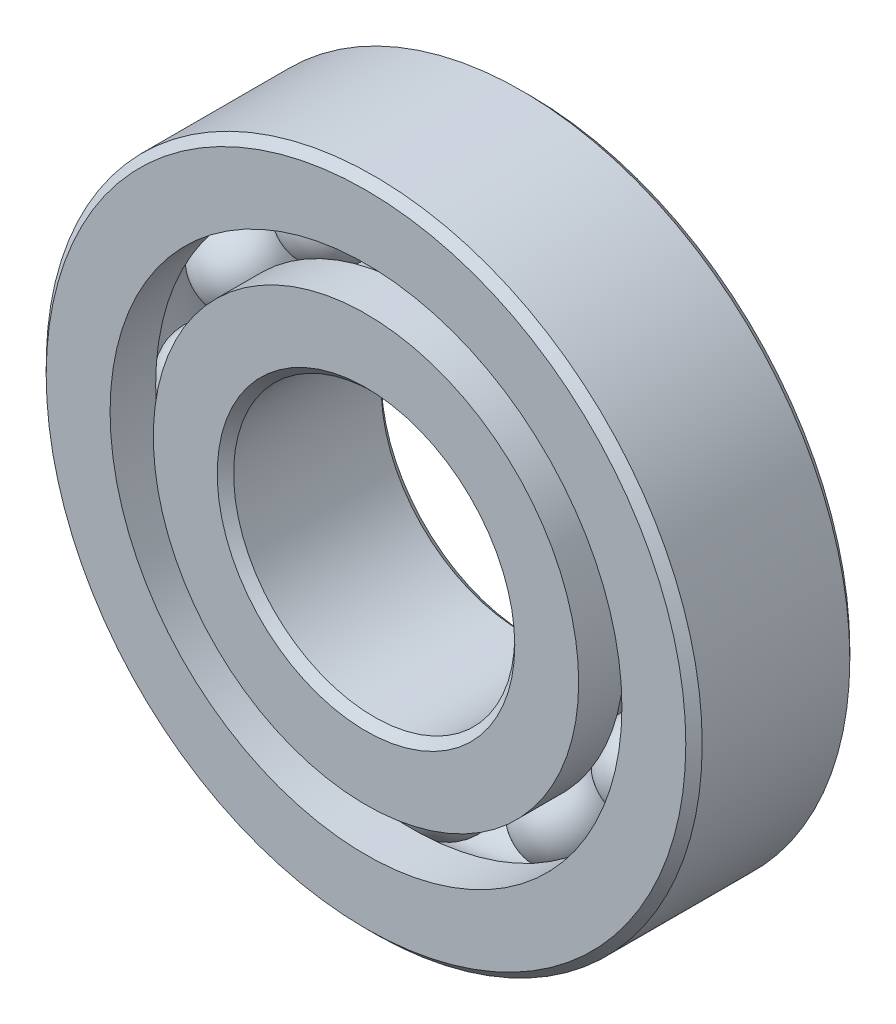
ISO-10303-21;
HEADER;
FILE_DESCRIPTION(('STEP AP214'),'2;1');
FILE_NAME('part.step','',(''),(''),'','','');
FILE_SCHEMA(('AUTOMOTIVE_DESIGN { 1 0 10303 214 1 1 1 1 }'));
ENDSEC;
DATA;
#1=APPLICATION_CONTEXT('core data for automotive mechanical design processes');
#2=APPLICATION_PROTOCOL_DEFINITION('international standard','automotive_design',2000,#1);
#3=PRODUCT_CONTEXT('',#1,'mechanical');
#4=PRODUCT('Part','Part','',(#3));
#5=PRODUCT_RELATED_PRODUCT_CATEGORY('part','',(#4));
#6=PRODUCT_DEFINITION_FORMATION('','',#4);
#7=PRODUCT_DEFINITION_CONTEXT('part definition',#1,'design');
#8=PRODUCT_DEFINITION('design','',#6,#7);
#9=PRODUCT_DEFINITION_SHAPE('','',#8);
#10=(LENGTH_UNIT() NAMED_UNIT(*) SI_UNIT(.MILLI.,.METRE.));
#11=(NAMED_UNIT(*) PLANE_ANGLE_UNIT() SI_UNIT($,.RADIAN.));
#12=(NAMED_UNIT(*) SI_UNIT($,.STERADIAN.) SOLID_ANGLE_UNIT());
#13=UNCERTAINTY_MEASURE_WITH_UNIT(LENGTH_MEASURE(1.E-05),#10,'distance_accuracy_value','');
#14=(GEOMETRIC_REPRESENTATION_CONTEXT(3) GLOBAL_UNCERTAINTY_ASSIGNED_CONTEXT((#13)) GLOBAL_UNIT_ASSIGNED_CONTEXT((#10,
#11,#12)) REPRESENTATION_CONTEXT('',''));
#15=CARTESIAN_POINT('',(0.,0.,0.));
#16=DIRECTION('',(0.,0.,1.));
#17=DIRECTION('',(1.,0.,0.));
#18=AXIS2_PLACEMENT_3D('',#15,#16,#17);
#19=CARTESIAN_POINT('',(-3.96874999999991,6.87407664253903,0.));
#20=DIRECTION('',(0.,0.,1.));
#21=DIRECTION('',(-0.499999999999989,0.866025403784445,0.));
#22=AXIS2_PLACEMENT_3D('',#19,#20,#21);
#23=SPHERICAL_SURFACE('',#22,1.43574962434293);
#24=CARTESIAN_POINT('',(-3.96874999999991,6.87407664253903,1.43574962434293));
#25=VERTEX_POINT('',#24);
#26=VERTEX_LOOP('',#25);
#27=FACE_BOUND('',#26,.T.);
#28=ADVANCED_FACE('F41',(#27),#23,.T.);
#29=CLOSED_SHELL('',(#28));
#30=MANIFOLD_SOLID_BREP('B2',#29);
#31=CARTESIAN_POINT('',(-6.87407664253894,3.96875000000008,0.));
#32=DIRECTION('',(0.,0.,1.));
#33=DIRECTION('',(-0.866025403784433,0.50000000000001,0.));
#34=AXIS2_PLACEMENT_3D('',#31,#32,#33);
#35=SPHERICAL_SURFACE('',#34,1.43574962434293);
#36=CARTESIAN_POINT('',(-6.87407664253894,3.96875000000008,1.43574962434293));
#37=VERTEX_POINT('',#36);
#38=VERTEX_LOOP('',#37);
#39=FACE_BOUND('',#38,.T.);
#40=ADVANCED_FACE('F61',(#39),#35,.T.);
#41=CLOSED_SHELL('',(#40));
#42=MANIFOLD_SOLID_BREP('B6',#41);
#43=CARTESIAN_POINT('',(-7.9375,0.,0.));
#44=DIRECTION('',(0.,0.,1.));
#45=DIRECTION('',(-1.,0.,0.));
#46=AXIS2_PLACEMENT_3D('',#43,#44,#45);
#47=SPHERICAL_SURFACE('',#46,1.43574962434293);
#48=CARTESIAN_POINT('',(-7.9375,0.,1.43574962434293));
#49=VERTEX_POINT('',#48);
#50=VERTEX_LOOP('',#49);
#51=FACE_BOUND('',#50,.T.);
#52=ADVANCED_FACE('F81',(#51),#47,.T.);
#53=CLOSED_SHELL('',(#52));
#54=MANIFOLD_SOLID_BREP('B37',#53);
#55=CARTESIAN_POINT('',(-6.87407664253902,-3.96874999999994,0.));
#56=DIRECTION('',(0.,0.,1.));
#57=DIRECTION('',(-0.866025403784443,-0.499999999999992,0.));
#58=AXIS2_PLACEMENT_3D('',#55,#56,#57);
#59=SPHERICAL_SURFACE('',#58,1.43574962434293);
#60=CARTESIAN_POINT('',(-6.87407664253902,-3.96874999999994,1.43574962434293));
#61=VERTEX_POINT('',#60);
#62=VERTEX_LOOP('',#61);
#63=FACE_BOUND('',#62,.T.);
#64=ADVANCED_FACE('F101',(#63),#59,.T.);
#65=CLOSED_SHELL('',(#64));
#66=MANIFOLD_SOLID_BREP('B57',#65);
#67=CARTESIAN_POINT('',(-3.96875000000006,-6.87407664253895,0.));
#68=DIRECTION('',(0.,0.,1.));
#69=DIRECTION('',(-0.500000000000007,-0.866025403784435,0.));
#70=AXIS2_PLACEMENT_3D('',#67,#68,#69);
#71=SPHERICAL_SURFACE('',#70,1.43574962434293);
#72=CARTESIAN_POINT('',(-3.96875000000006,-6.87407664253895,1.43574962434293));
#73=VERTEX_POINT('',#72);
#74=VERTEX_LOOP('',#73);
#75=FACE_BOUND('',#74,.T.);
#76=ADVANCED_FACE('F121',(#75),#71,.T.);
#77=CLOSED_SHELL('',(#76));
#78=MANIFOLD_SOLID_BREP('B77',#77);
#79=CARTESIAN_POINT('',(0.,-7.9375,0.));
#80=DIRECTION('',(0.,0.,1.));
#81=DIRECTION('',(0.,-1.,0.));
#82=AXIS2_PLACEMENT_3D('',#79,#80,#81);
#83=SPHERICAL_SURFACE('',#82,1.43574962434293);
#84=CARTESIAN_POINT('',(0.,-7.9375,1.43574962434293));
#85=VERTEX_POINT('',#84);
#86=VERTEX_LOOP('',#85);
#87=FACE_BOUND('',#86,.T.);
#88=ADVANCED_FACE('F141',(#87),#83,.T.);
#89=CLOSED_SHELL('',(#88));
#90=MANIFOLD_SOLID_BREP('B97',#89);
#91=CARTESIAN_POINT('',(3.96874999999996,-6.87407664253901,0.));
#92=DIRECTION('',(0.,0.,1.));
#93=DIRECTION('',(0.499999999999995,-0.866025403784442,0.));
#94=AXIS2_PLACEMENT_3D('',#91,#92,#93);
#95=SPHERICAL_SURFACE('',#94,1.43574962434293);
#96=CARTESIAN_POINT('',(3.96874999999996,-6.87407664253901,1.43574962434293));
#97=VERTEX_POINT('',#96);
#98=VERTEX_LOOP('',#97);
#99=FACE_BOUND('',#98,.T.);
#100=ADVANCED_FACE('F161',(#99),#95,.T.);
#101=CLOSED_SHELL('',(#100));
#102=MANIFOLD_SOLID_BREP('B117',#101);
#103=CARTESIAN_POINT('',(6.87407664253896,-3.96875000000003,0.));
#104=DIRECTION('',(0.,0.,1.));
#105=DIRECTION('',(0.866025403784436,-0.500000000000004,0.));
#106=AXIS2_PLACEMENT_3D('',#103,#104,#105);
#107=SPHERICAL_SURFACE('',#106,1.43574962434293);
#108=CARTESIAN_POINT('',(6.87407664253896,-3.96875000000003,1.43574962434293));
#109=VERTEX_POINT('',#108);
#110=VERTEX_LOOP('',#109);
#111=FACE_BOUND('',#110,.T.);
#112=ADVANCED_FACE('F181',(#111),#107,.T.);
#113=CLOSED_SHELL('',(#112));
#114=MANIFOLD_SOLID_BREP('B137',#113);
#115=CARTESIAN_POINT('',(7.9375,0.,0.));
#116=DIRECTION('',(0.,0.,1.));
#117=DIRECTION('',(1.,0.,0.));
#118=AXIS2_PLACEMENT_3D('',#115,#116,#117);
#119=SPHERICAL_SURFACE('',#118,1.43574962434293);
#120=CARTESIAN_POINT('',(7.9375,0.,1.43574962434293));
#121=VERTEX_POINT('',#120);
#122=VERTEX_LOOP('',#121);
#123=FACE_BOUND('',#122,.T.);
#124=ADVANCED_FACE('F201',(#123),#119,.T.);
#125=CLOSED_SHELL('',(#124));
#126=MANIFOLD_SOLID_BREP('B157',#125);
#127=CARTESIAN_POINT('',(6.87407664253899,3.96874999999998,0.));
#128=DIRECTION('',(0.,0.,1.));
#129=DIRECTION('',(0.86602540378444,0.499999999999998,0.));
#130=AXIS2_PLACEMENT_3D('',#127,#128,#129);
#131=SPHERICAL_SURFACE('',#130,1.43574962434293);
#132=CARTESIAN_POINT('',(6.87407664253899,3.96874999999998,1.43574962434293));
#133=VERTEX_POINT('',#132);
#134=VERTEX_LOOP('',#133);
#135=FACE_BOUND('',#134,.T.);
#136=ADVANCED_FACE('F221',(#135),#131,.T.);
#137=CLOSED_SHELL('',(#136));
#138=MANIFOLD_SOLID_BREP('B177',#137);
#139=CARTESIAN_POINT('',(3.96875000000001,6.87407664253898,0.));
#140=DIRECTION('',(0.,0.,1.));
#141=DIRECTION('',(0.500000000000001,0.866025403784438,0.));
#142=AXIS2_PLACEMENT_3D('',#139,#140,#141);
#143=SPHERICAL_SURFACE('',#142,1.43574962434293);
#144=CARTESIAN_POINT('',(3.96875000000001,6.87407664253898,1.43574962434293));
#145=VERTEX_POINT('',#144);
#146=VERTEX_LOOP('',#145);
#147=FACE_BOUND('',#146,.T.);
#148=ADVANCED_FACE('F241',(#147),#143,.T.);
#149=CLOSED_SHELL('',(#148));
#150=MANIFOLD_SOLID_BREP('B197',#149);
#151=CARTESIAN_POINT('',(0.,7.9375,0.));
#152=DIRECTION('',(0.,0.,1.));
#153=DIRECTION('',(0.,1.,0.));
#154=AXIS2_PLACEMENT_3D('',#151,#152,#153);
#155=SPHERICAL_SURFACE('',#154,1.43574962434293);
#156=CARTESIAN_POINT('',(0.,7.9375,1.43574962434293));
#157=VERTEX_POINT('',#156);
#158=VERTEX_LOOP('',#157);
#159=FACE_BOUND('',#158,.T.);
#160=ADVANCED_FACE('F263',(#159),#155,.T.);
#161=CLOSED_SHELL('',(#160));
#162=MANIFOLD_SOLID_BREP('B217',#161);
#163=CARTESIAN_POINT('',(0.,7.20480769230769,2.778125));
#164=DIRECTION('',(0.,0.,-1.));
#165=DIRECTION('',(-1.,0.,0.));
#166=AXIS2_PLACEMENT_3D('',#163,#164,#165);
#167=PLANE('',#166);
#168=CARTESIAN_POINT('',(0.,0.,2.778125));
#169=DIRECTION('',(0.,0.,1.));
#170=DIRECTION('',(1.,0.,0.));
#171=AXIS2_PLACEMENT_3D('',#168,#169,#170);
#172=CIRCLE('',#171,5.0403125);
#173=CARTESIAN_POINT('',(5.0403125,0.,2.778125));
#174=VERTEX_POINT('',#173);
#175=EDGE_CURVE('E310',#174,#174,#172,.T.);
#176=ORIENTED_EDGE('',*,*,#175,.F.);
#177=EDGE_LOOP('',(#176));
#178=FACE_BOUND('',#177,.T.);
#179=CARTESIAN_POINT('',(0.,0.,2.778125));
#180=DIRECTION('',(0.,0.,1.));
#181=DIRECTION('',(1.,0.,0.));
#182=AXIS2_PLACEMENT_3D('',#179,#180,#181);
#183=CIRCLE('',#182,7.20480769230769);
#184=CARTESIAN_POINT('',(7.20480769230769,0.,2.778125));
#185=VERTEX_POINT('',#184);
#186=EDGE_CURVE('E262',#185,#185,#183,.T.);
#187=ORIENTED_EDGE('',*,*,#186,.T.);
#188=EDGE_LOOP('',(#187));
#189=FACE_BOUND('',#188,.T.);
#190=ADVANCED_FACE('F282',(#178,#189),#167,.F.);
#191=CARTESIAN_POINT('',(0.,0.,2.778125));
#192=DIRECTION('',(0.,0.,1.));
#193=DIRECTION('',(1.,0.,0.));
#194=AXIS2_PLACEMENT_3D('',#191,#192,#193);
#195=CYLINDRICAL_SURFACE('',#194,7.20480769230769);
#196=ORIENTED_EDGE('',*,*,#186,.F.);
#197=EDGE_LOOP('',(#196));
#198=FACE_BOUND('',#197,.T.);
#199=CARTESIAN_POINT('',(0.,0.,1.23472222222222));
#200=DIRECTION('',(0.,0.,1.));
#201=DIRECTION('',(1.,0.,0.));
#202=AXIS2_PLACEMENT_3D('',#199,#200,#201);
#203=CIRCLE('',#202,7.20480769230769);
#204=CARTESIAN_POINT('',(7.20480769230769,0.,1.23472222222222));
#205=VERTEX_POINT('',#204);
#206=EDGE_CURVE('E288',#205,#205,#203,.T.);
#207=ORIENTED_EDGE('',*,*,#206,.T.);
#208=EDGE_LOOP('',(#207));
#209=FACE_BOUND('',#208,.T.);
#210=ADVANCED_FACE('F317',(#198,#209),#195,.T.);
#211=CARTESIAN_POINT('',(0.,0.,0.));
#212=DIRECTION('',(0.,0.,1.));
#213=DIRECTION('',(1.,0.,0.));
#214=AXIS2_PLACEMENT_3D('',#211,#212,#213);
#215=TOROIDAL_SURFACE('',#214,7.93749999999999,1.43574962434293);
#216=ORIENTED_EDGE('',*,*,#206,.F.);
#217=EDGE_LOOP('',(#216));
#218=FACE_BOUND('',#217,.T.);
#219=CARTESIAN_POINT('',(0.,0.,-1.23472222222222));
#220=DIRECTION('',(0.,0.,1.));
#221=DIRECTION('',(1.,0.,0.));
#222=AXIS2_PLACEMENT_3D('',#219,#220,#221);
#223=CIRCLE('',#222,7.20480769230769);
#224=CARTESIAN_POINT('',(7.20480769230769,0.,-1.23472222222222));
#225=VERTEX_POINT('',#224);
#226=EDGE_CURVE('E292',#225,#225,#223,.T.);
#227=ORIENTED_EDGE('',*,*,#226,.T.);
#228=EDGE_LOOP('',(#227));
#229=FACE_BOUND('',#228,.T.);
#230=ADVANCED_FACE('F321',(#218,#229),#215,.F.);
#231=CARTESIAN_POINT('',(0.,0.,2.778125));
#232=DIRECTION('',(0.,0.,1.));
#233=DIRECTION('',(1.,0.,0.));
#234=AXIS2_PLACEMENT_3D('',#231,#232,#233);
#235=CYLINDRICAL_SURFACE('',#234,7.20480769230769);
#236=ORIENTED_EDGE('',*,*,#226,.F.);
#237=EDGE_LOOP('',(#236));
#238=FACE_BOUND('',#237,.T.);
#239=CARTESIAN_POINT('',(0.,0.,-2.778125));
#240=DIRECTION('',(0.,0.,1.));
#241=DIRECTION('',(1.,0.,0.));
#242=AXIS2_PLACEMENT_3D('',#239,#240,#241);
#243=CIRCLE('',#242,7.20480769230769);
#244=CARTESIAN_POINT('',(7.20480769230769,0.,-2.778125));
#245=VERTEX_POINT('',#244);
#246=EDGE_CURVE('E296',#245,#245,#243,.T.);
#247=ORIENTED_EDGE('',*,*,#246,.T.);
#248=EDGE_LOOP('',(#247));
#249=FACE_BOUND('',#248,.T.);
#250=ADVANCED_FACE('F326',(#238,#249),#235,.T.);
#251=CARTESIAN_POINT('',(0.,5.0403125,-2.778125));
#252=DIRECTION('',(0.,0.,1.));
#253=DIRECTION('',(1.,0.,0.));
#254=AXIS2_PLACEMENT_3D('',#251,#252,#253);
#255=PLANE('',#254);
#256=ORIENTED_EDGE('',*,*,#246,.F.);
#257=EDGE_LOOP('',(#256));
#258=FACE_BOUND('',#257,.T.);
#259=CARTESIAN_POINT('',(0.,0.,-2.778125));
#260=DIRECTION('',(0.,0.,1.));
#261=DIRECTION('',(1.,0.,0.));
#262=AXIS2_PLACEMENT_3D('',#259,#260,#261);
#263=CIRCLE('',#262,5.0403125);
#264=CARTESIAN_POINT('',(5.0403125,0.,-2.778125));
#265=VERTEX_POINT('',#264);
#266=EDGE_CURVE('E301',#265,#265,#263,.T.);
#267=ORIENTED_EDGE('',*,*,#266,.T.);
#268=EDGE_LOOP('',(#267));
#269=FACE_BOUND('',#268,.T.);
#270=ADVANCED_FACE('F332',(#258,#269),#255,.F.);
#271=CARTESIAN_POINT('',(0.,0.,-2.5003125));
#272=DIRECTION('',(0.,0.,-1.));
#273=DIRECTION('',(-1.,0.,0.));
#274=AXIS2_PLACEMENT_3D('',#271,#272,#273);
#275=CONICAL_SURFACE('',#274,4.7625,0.78539816339745);
#276=ORIENTED_EDGE('',*,*,#266,.F.);
#277=EDGE_LOOP('',(#276));
#278=FACE_BOUND('',#277,.T.);
#279=CARTESIAN_POINT('',(0.,0.,-2.5003125));
#280=DIRECTION('',(0.,0.,1.));
#281=DIRECTION('',(1.,0.,0.));
#282=AXIS2_PLACEMENT_3D('',#279,#280,#281);
#283=CIRCLE('',#282,4.7625);
#284=CARTESIAN_POINT('',(4.7625,0.,-2.5003125));
#285=VERTEX_POINT('',#284);
#286=EDGE_CURVE('E304',#285,#285,#283,.T.);
#287=ORIENTED_EDGE('',*,*,#286,.T.);
#288=EDGE_LOOP('',(#287));
#289=FACE_BOUND('',#288,.T.);
#290=ADVANCED_FACE('F336',(#278,#289),#275,.F.);
#291=CARTESIAN_POINT('',(0.,0.,2.778125));
#292=DIRECTION('',(0.,0.,1.));
#293=DIRECTION('',(1.,0.,0.));
#294=AXIS2_PLACEMENT_3D('',#291,#292,#293);
#295=CYLINDRICAL_SURFACE('',#294,4.7625);
#296=ORIENTED_EDGE('',*,*,#286,.F.);
#297=EDGE_LOOP('',(#296));
#298=FACE_BOUND('',#297,.T.);
#299=CARTESIAN_POINT('',(0.,0.,2.5003125));
#300=DIRECTION('',(0.,0.,1.));
#301=DIRECTION('',(1.,0.,0.));
#302=AXIS2_PLACEMENT_3D('',#299,#300,#301);
#303=CIRCLE('',#302,4.7625);
#304=CARTESIAN_POINT('',(4.7625,0.,2.5003125));
#305=VERTEX_POINT('',#304);
#306=EDGE_CURVE('E307',#305,#305,#303,.T.);
#307=ORIENTED_EDGE('',*,*,#306,.T.);
#308=EDGE_LOOP('',(#307));
#309=FACE_BOUND('',#308,.T.);
#310=ADVANCED_FACE('F340',(#298,#309),#295,.F.);
#311=CARTESIAN_POINT('',(0.,0.,2.778125));
#312=DIRECTION('',(0.,0.,1.));
#313=DIRECTION('',(1.,0.,0.));
#314=AXIS2_PLACEMENT_3D('',#311,#312,#313);
#315=CONICAL_SURFACE('',#314,5.0403125,0.785398163397448);
#316=ORIENTED_EDGE('',*,*,#306,.F.);
#317=EDGE_LOOP('',(#316));
#318=FACE_BOUND('',#317,.T.);
#319=ORIENTED_EDGE('',*,*,#175,.T.);
#320=EDGE_LOOP('',(#319));
#321=FACE_BOUND('',#320,.T.);
#322=ADVANCED_FACE('F314',(#318,#321),#315,.F.);
#323=CLOSED_SHELL('',(#190,#210,#230,#250,#270,#290,#310,#322));
#324=MANIFOLD_SOLID_BREP('B237',#323);
#325=CARTESIAN_POINT('',(0.,0.,2.5003125));
#326=DIRECTION('',(0.,0.,-1.));
#327=DIRECTION('',(-1.,0.,0.));
#328=AXIS2_PLACEMENT_3D('',#325,#326,#327);
#329=CONICAL_SURFACE('',#328,11.1125,0.785398163397451);
#330=CARTESIAN_POINT('',(0.,0.,2.778125));
#331=DIRECTION('',(0.,0.,1.));
#332=DIRECTION('',(1.,0.,0.));
#333=AXIS2_PLACEMENT_3D('',#330,#331,#332);
#334=CIRCLE('',#333,10.8346875);
#335=CARTESIAN_POINT('',(10.8346875,0.,2.778125));
#336=VERTEX_POINT('',#335);
#337=EDGE_CURVE('E431',#336,#336,#334,.T.);
#338=ORIENTED_EDGE('',*,*,#337,.F.);
#339=EDGE_LOOP('',(#338));
#340=FACE_BOUND('',#339,.T.);
#341=CARTESIAN_POINT('',(0.,0.,2.5003125));
#342=DIRECTION('',(0.,0.,1.));
#343=DIRECTION('',(1.,0.,0.));
#344=AXIS2_PLACEMENT_3D('',#341,#342,#343);
#345=CIRCLE('',#344,11.1125);
#346=CARTESIAN_POINT('',(11.1125,0.,2.5003125));
#347=VERTEX_POINT('',#346);
#348=EDGE_CURVE('E281',#347,#347,#345,.T.);
#349=ORIENTED_EDGE('',*,*,#348,.T.);
#350=EDGE_LOOP('',(#349));
#351=FACE_BOUND('',#350,.T.);
#352=ADVANCED_FACE('F403',(#340,#351),#329,.T.);
#353=CARTESIAN_POINT('',(0.,0.,2.778125));
#354=DIRECTION('',(0.,0.,1.));
#355=DIRECTION('',(1.,0.,0.));
#356=AXIS2_PLACEMENT_3D('',#353,#354,#355);
#357=CYLINDRICAL_SURFACE('',#356,11.1125);
#358=ORIENTED_EDGE('',*,*,#348,.F.);
#359=EDGE_LOOP('',(#358));
#360=FACE_BOUND('',#359,.T.);
#361=CARTESIAN_POINT('',(0.,0.,-2.5003125));
#362=DIRECTION('',(0.,0.,1.));
#363=DIRECTION('',(1.,0.,0.));
#364=AXIS2_PLACEMENT_3D('',#361,#362,#363);
#365=CIRCLE('',#364,11.1125);
#366=CARTESIAN_POINT('',(11.1125,0.,-2.5003125));
#367=VERTEX_POINT('',#366);
#368=EDGE_CURVE('E409',#367,#367,#365,.T.);
#369=ORIENTED_EDGE('',*,*,#368,.T.);
#370=EDGE_LOOP('',(#369));
#371=FACE_BOUND('',#370,.T.);
#372=ADVANCED_FACE('F438',(#360,#371),#357,.T.);
#373=CARTESIAN_POINT('',(0.,0.,-2.778125));
#374=DIRECTION('',(0.,0.,1.));
#375=DIRECTION('',(1.,0.,0.));
#376=AXIS2_PLACEMENT_3D('',#373,#374,#375);
#377=CONICAL_SURFACE('',#376,10.8346875,0.785398163397451);
#378=ORIENTED_EDGE('',*,*,#368,.F.);
#379=EDGE_LOOP('',(#378));
#380=FACE_BOUND('',#379,.T.);
#381=CARTESIAN_POINT('',(0.,0.,-2.778125));
#382=DIRECTION('',(0.,0.,1.));
#383=DIRECTION('',(1.,0.,0.));
#384=AXIS2_PLACEMENT_3D('',#381,#382,#383);
#385=CIRCLE('',#384,10.8346875);
#386=CARTESIAN_POINT('',(10.8346875,0.,-2.778125));
#387=VERTEX_POINT('',#386);
#388=EDGE_CURVE('E413',#387,#387,#385,.T.);
#389=ORIENTED_EDGE('',*,*,#388,.T.);
#390=EDGE_LOOP('',(#389));
#391=FACE_BOUND('',#390,.T.);
#392=ADVANCED_FACE('F442',(#380,#391),#377,.T.);
#393=CARTESIAN_POINT('',(0.,10.8346875,-2.778125));
#394=DIRECTION('',(0.,0.,1.));
#395=DIRECTION('',(1.,0.,0.));
#396=AXIS2_PLACEMENT_3D('',#393,#394,#395);
#397=PLANE('',#396);
#398=ORIENTED_EDGE('',*,*,#388,.F.);
#399=EDGE_LOOP('',(#398));
#400=FACE_BOUND('',#399,.T.);
#401=CARTESIAN_POINT('',(0.,0.,-2.778125));
#402=DIRECTION('',(0.,0.,1.));
#403=DIRECTION('',(1.,0.,0.));
#404=AXIS2_PLACEMENT_3D('',#401,#402,#403);
#405=CIRCLE('',#404,8.67019230769231);
#406=CARTESIAN_POINT('',(8.67019230769231,0.,-2.778125));
#407=VERTEX_POINT('',#406);
#408=EDGE_CURVE('E417',#407,#407,#405,.T.);
#409=ORIENTED_EDGE('',*,*,#408,.T.);
#410=EDGE_LOOP('',(#409));
#411=FACE_BOUND('',#410,.T.);
#412=ADVANCED_FACE('F447',(#400,#411),#397,.F.);
#413=CARTESIAN_POINT('',(0.,0.,2.778125));
#414=DIRECTION('',(0.,0.,1.));
#415=DIRECTION('',(1.,0.,0.));
#416=AXIS2_PLACEMENT_3D('',#413,#414,#415);
#417=CYLINDRICAL_SURFACE('',#416,8.67019230769231);
#418=ORIENTED_EDGE('',*,*,#408,.F.);
#419=EDGE_LOOP('',(#418));
#420=FACE_BOUND('',#419,.T.);
#421=CARTESIAN_POINT('',(0.,0.,-1.23472222222222));
#422=DIRECTION('',(0.,0.,1.));
#423=DIRECTION('',(1.,0.,0.));
#424=AXIS2_PLACEMENT_3D('',#421,#422,#423);
#425=CIRCLE('',#424,8.67019230769231);
#426=CARTESIAN_POINT('',(8.67019230769231,0.,-1.23472222222222));
#427=VERTEX_POINT('',#426);
#428=EDGE_CURVE('E422',#427,#427,#425,.T.);
#429=ORIENTED_EDGE('',*,*,#428,.T.);
#430=EDGE_LOOP('',(#429));
#431=FACE_BOUND('',#430,.T.);
#432=ADVANCED_FACE('F453',(#420,#431),#417,.F.);
#433=CARTESIAN_POINT('',(0.,0.,0.));
#434=DIRECTION('',(0.,0.,1.));
#435=DIRECTION('',(1.,0.,0.));
#436=AXIS2_PLACEMENT_3D('',#433,#434,#435);
#437=TOROIDAL_SURFACE('',#436,7.9375,1.43574962434293);
#438=ORIENTED_EDGE('',*,*,#428,.F.);
#439=EDGE_LOOP('',(#438));
#440=FACE_BOUND('',#439,.T.);
#441=CARTESIAN_POINT('',(0.,0.,1.23472222222222));
#442=DIRECTION('',(0.,0.,1.));
#443=DIRECTION('',(1.,0.,0.));
#444=AXIS2_PLACEMENT_3D('',#441,#442,#443);
#445=CIRCLE('',#444,8.67019230769231);
#446=CARTESIAN_POINT('',(8.67019230769231,0.,1.23472222222222));
#447=VERTEX_POINT('',#446);
#448=EDGE_CURVE('E425',#447,#447,#445,.T.);
#449=ORIENTED_EDGE('',*,*,#448,.T.);
#450=EDGE_LOOP('',(#449));
#451=FACE_BOUND('',#450,.T.);
#452=ADVANCED_FACE('F457',(#440,#451),#437,.F.);
#453=CARTESIAN_POINT('',(0.,0.,2.778125));
#454=DIRECTION('',(0.,0.,1.));
#455=DIRECTION('',(1.,0.,0.));
#456=AXIS2_PLACEMENT_3D('',#453,#454,#455);
#457=CYLINDRICAL_SURFACE('',#456,8.67019230769231);
#458=ORIENTED_EDGE('',*,*,#448,.F.);
#459=EDGE_LOOP('',(#458));
#460=FACE_BOUND('',#459,.T.);
#461=CARTESIAN_POINT('',(0.,0.,2.778125));
#462=DIRECTION('',(0.,0.,1.));
#463=DIRECTION('',(1.,0.,0.));
#464=AXIS2_PLACEMENT_3D('',#461,#462,#463);
#465=CIRCLE('',#464,8.67019230769231);
#466=CARTESIAN_POINT('',(8.67019230769231,0.,2.778125));
#467=VERTEX_POINT('',#466);
#468=EDGE_CURVE('E428',#467,#467,#465,.T.);
#469=ORIENTED_EDGE('',*,*,#468,.T.);
#470=EDGE_LOOP('',(#469));
#471=FACE_BOUND('',#470,.T.);
#472=ADVANCED_FACE('F461',(#460,#471),#457,.F.);
#473=CARTESIAN_POINT('',(0.,10.8346875,2.778125));
#474=DIRECTION('',(0.,0.,-1.));
#475=DIRECTION('',(-1.,0.,0.));
#476=AXIS2_PLACEMENT_3D('',#473,#474,#475);
#477=PLANE('',#476);
#478=ORIENTED_EDGE('',*,*,#468,.F.);
#479=EDGE_LOOP('',(#478));
#480=FACE_BOUND('',#479,.T.);
#481=ORIENTED_EDGE('',*,*,#337,.T.);
#482=EDGE_LOOP('',(#481));
#483=FACE_BOUND('',#482,.T.);
#484=ADVANCED_FACE('F435',(#480,#483),#477,.F.);
#485=CLOSED_SHELL('',(#352,#372,#392,#412,#432,#452,#472,#484));
#486=MANIFOLD_SOLID_BREP('B257',#485);
#487=ADVANCED_BREP_SHAPE_REPRESENTATION('',(#18,#30,#42,#54,#66,#78,#90,#102,#114,#126,#138,
#150,#162,#324,#486),#14);
#488=SHAPE_DEFINITION_REPRESENTATION(#9,#487);
ENDSEC;
END-ISO-10303-21;
